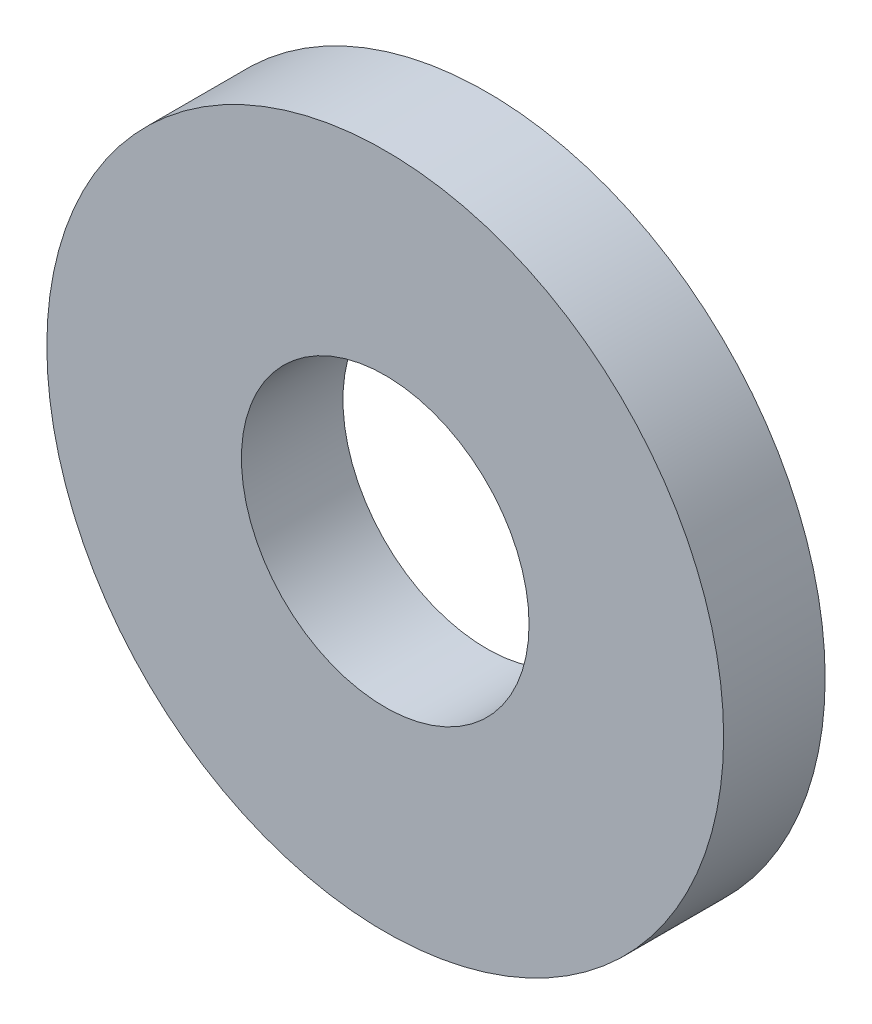
ISO-10303-21;
HEADER;
FILE_DESCRIPTION(('STEP AP214'),'2;1');
FILE_NAME('part.step','',(''),(''),'','','');
FILE_SCHEMA(('AUTOMOTIVE_DESIGN { 1 0 10303 214 1 1 1 1 }'));
ENDSEC;
DATA;
#1=APPLICATION_CONTEXT('core data for automotive mechanical design processes');
#2=APPLICATION_PROTOCOL_DEFINITION('international standard','automotive_design',2000,#1);
#3=PRODUCT_CONTEXT('',#1,'mechanical');
#4=PRODUCT('Part','Part','',(#3));
#5=PRODUCT_RELATED_PRODUCT_CATEGORY('part','',(#4));
#6=PRODUCT_DEFINITION_FORMATION('','',#4);
#7=PRODUCT_DEFINITION_CONTEXT('part definition',#1,'design');
#8=PRODUCT_DEFINITION('design','',#6,#7);
#9=PRODUCT_DEFINITION_SHAPE('','',#8);
#10=(LENGTH_UNIT() NAMED_UNIT(*) SI_UNIT(.MILLI.,.METRE.));
#11=(NAMED_UNIT(*) PLANE_ANGLE_UNIT() SI_UNIT($,.RADIAN.));
#12=(NAMED_UNIT(*) SI_UNIT($,.STERADIAN.) SOLID_ANGLE_UNIT());
#13=UNCERTAINTY_MEASURE_WITH_UNIT(LENGTH_MEASURE(1.E-05),#10,'distance_accuracy_value','');
#14=(GEOMETRIC_REPRESENTATION_CONTEXT(3) GLOBAL_UNCERTAINTY_ASSIGNED_CONTEXT((#13)) GLOBAL_UNIT_ASSIGNED_CONTEXT((#10,
#11,#12)) REPRESENTATION_CONTEXT('',''));
#15=CARTESIAN_POINT('',(0.,0.,0.));
#16=DIRECTION('',(0.,0.,1.));
#17=DIRECTION('',(1.,0.,0.));
#18=AXIS2_PLACEMENT_3D('',#15,#16,#17);
#19=CARTESIAN_POINT('',(349.999999999989,59.9999999999981,6.));
#20=DIRECTION('',(0.,0.,1.));
#21=DIRECTION('',(1.,0.,0.));
#22=AXIS2_PLACEMENT_3D('',#19,#20,#21);
#23=PLANE('',#22);
#24=CARTESIAN_POINT('',(349.999999999989,59.9999999999981,6.));
#25=DIRECTION('',(0.,0.,1.));
#26=DIRECTION('',(1.,0.,0.));
#27=AXIS2_PLACEMENT_3D('',#24,#25,#26);
#28=CIRCLE('',#27,20.);
#29=CARTESIAN_POINT('',(369.999999999989,59.9999999999981,6.));
#30=VERTEX_POINT('',#29);
#31=EDGE_CURVE('E10',#30,#30,#28,.T.);
#32=ORIENTED_EDGE('',*,*,#31,.T.);
#33=EDGE_LOOP('',(#32));
#34=FACE_BOUND('',#33,.T.);
#35=CARTESIAN_POINT('',(349.999999999989,59.9999999999981,6.));
#36=DIRECTION('',(0.,0.,1.));
#37=DIRECTION('',(1.,0.,0.));
#38=AXIS2_PLACEMENT_3D('',#35,#36,#37);
#39=CIRCLE('',#38,8.50000000000001);
#40=CARTESIAN_POINT('',(358.499999999989,59.9999999999981,6.));
#41=VERTEX_POINT('',#40);
#42=EDGE_CURVE('E48',#41,#41,#39,.T.);
#43=ORIENTED_EDGE('',*,*,#42,.F.);
#44=EDGE_LOOP('',(#43));
#45=FACE_BOUND('',#44,.T.);
#46=ADVANCED_FACE('F34',(#34,#45),#23,.T.);
#47=CARTESIAN_POINT('',(349.999999999989,59.9999999999981,0.));
#48=DIRECTION('',(0.,0.,1.));
#49=DIRECTION('',(1.,0.,0.));
#50=AXIS2_PLACEMENT_3D('',#47,#48,#49);
#51=PLANE('',#50);
#52=CARTESIAN_POINT('',(349.999999999989,59.9999999999981,0.));
#53=DIRECTION('',(0.,0.,1.));
#54=DIRECTION('',(1.,0.,0.));
#55=AXIS2_PLACEMENT_3D('',#52,#53,#54);
#56=CIRCLE('',#55,20.);
#57=CARTESIAN_POINT('',(369.999999999989,59.9999999999981,0.));
#58=VERTEX_POINT('',#57);
#59=EDGE_CURVE('E38',#58,#58,#56,.T.);
#60=ORIENTED_EDGE('',*,*,#59,.F.);
#61=EDGE_LOOP('',(#60));
#62=FACE_BOUND('',#61,.T.);
#63=CARTESIAN_POINT('',(349.999999999989,59.9999999999981,0.));
#64=DIRECTION('',(0.,0.,1.));
#65=DIRECTION('',(1.,0.,0.));
#66=AXIS2_PLACEMENT_3D('',#63,#64,#65);
#67=CIRCLE('',#66,8.50000000000001);
#68=CARTESIAN_POINT('',(358.499999999989,59.9999999999981,0.));
#69=VERTEX_POINT('',#68);
#70=EDGE_CURVE('E50',#69,#69,#67,.T.);
#71=ORIENTED_EDGE('',*,*,#70,.T.);
#72=EDGE_LOOP('',(#71));
#73=FACE_BOUND('',#72,.T.);
#74=ADVANCED_FACE('F61',(#62,#73),#51,.F.);
#75=CARTESIAN_POINT('',(349.999999999989,59.9999999999981,6.));
#76=DIRECTION('',(0.,0.,-1.));
#77=DIRECTION('',(-1.,0.,0.));
#78=AXIS2_PLACEMENT_3D('',#75,#76,#77);
#79=CYLINDRICAL_SURFACE('',#78,20.);
#80=ORIENTED_EDGE('',*,*,#31,.F.);
#81=EDGE_LOOP('',(#80));
#82=FACE_BOUND('',#81,.T.);
#83=ORIENTED_EDGE('',*,*,#59,.T.);
#84=EDGE_LOOP('',(#83));
#85=FACE_BOUND('',#84,.T.);
#86=ADVANCED_FACE('F36',(#82,#85),#79,.T.);
#87=CARTESIAN_POINT('',(349.999999999989,59.9999999999981,6.));
#88=DIRECTION('',(0.,0.,-1.));
#89=DIRECTION('',(-1.,0.,0.));
#90=AXIS2_PLACEMENT_3D('',#87,#88,#89);
#91=CYLINDRICAL_SURFACE('',#90,8.50000000000001);
#92=ORIENTED_EDGE('',*,*,#42,.T.);
#93=EDGE_LOOP('',(#92));
#94=FACE_BOUND('',#93,.T.);
#95=ORIENTED_EDGE('',*,*,#70,.F.);
#96=EDGE_LOOP('',(#95));
#97=FACE_BOUND('',#96,.T.);
#98=ADVANCED_FACE('F57',(#94,#97),#91,.F.);
#99=CLOSED_SHELL('',(#46,#74,#86,#98));
#100=MANIFOLD_SOLID_BREP('B2',#99);
#101=ADVANCED_BREP_SHAPE_REPRESENTATION('',(#18,#100),#14);
#102=SHAPE_DEFINITION_REPRESENTATION(#9,#101);
ENDSEC;
END-ISO-10303-21;
